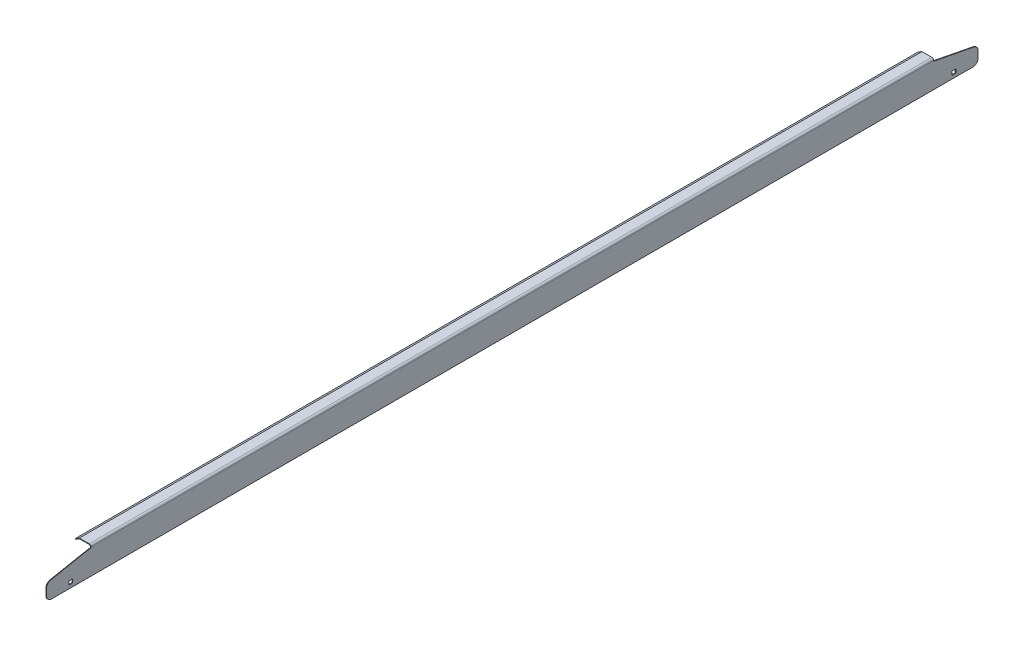
ISO-10303-21;
HEADER;
FILE_DESCRIPTION(('STEP AP214'),'2;1');
FILE_NAME('part.step','',(''),(''),'','','');
FILE_SCHEMA(('AUTOMOTIVE_DESIGN { 1 0 10303 214 1 1 1 1 }'));
ENDSEC;
DATA;
#1=APPLICATION_CONTEXT('core data for automotive mechanical design processes');
#2=APPLICATION_PROTOCOL_DEFINITION('international standard','automotive_design',2000,#1);
#3=PRODUCT_CONTEXT('',#1,'mechanical');
#4=PRODUCT('Part','Part','',(#3));
#5=PRODUCT_RELATED_PRODUCT_CATEGORY('part','',(#4));
#6=PRODUCT_DEFINITION_FORMATION('','',#4);
#7=PRODUCT_DEFINITION_CONTEXT('part definition',#1,'design');
#8=PRODUCT_DEFINITION('design','',#6,#7);
#9=PRODUCT_DEFINITION_SHAPE('','',#8);
#10=(LENGTH_UNIT() NAMED_UNIT(*) SI_UNIT(.MILLI.,.METRE.));
#11=(NAMED_UNIT(*) PLANE_ANGLE_UNIT() SI_UNIT($,.RADIAN.));
#12=(NAMED_UNIT(*) SI_UNIT($,.STERADIAN.) SOLID_ANGLE_UNIT());
#13=UNCERTAINTY_MEASURE_WITH_UNIT(LENGTH_MEASURE(1.E-05),#10,'distance_accuracy_value','');
#14=(GEOMETRIC_REPRESENTATION_CONTEXT(3) GLOBAL_UNCERTAINTY_ASSIGNED_CONTEXT((#13)) GLOBAL_UNIT_ASSIGNED_CONTEXT((#10,
#11,#12)) REPRESENTATION_CONTEXT('',''));
#15=CARTESIAN_POINT('',(0.,0.,0.));
#16=DIRECTION('',(0.,0.,1.));
#17=DIRECTION('',(1.,0.,0.));
#18=AXIS2_PLACEMENT_3D('',#15,#16,#17);
#19=CARTESIAN_POINT('',(1122.68,31.75,599.28125));
#20=DIRECTION('',(0.855197831640066,0.518301715951365,0.));
#21=DIRECTION('',(-0.518301715951365,0.855197831640066,0.));
#22=AXIS2_PLACEMENT_3D('',#19,#20,#21);
#23=PLANE('',#22);
#24=DIRECTION('',(0.518301716093364,-0.855197831554006,0.));
#25=VECTOR('',#24,1.);
#26=CARTESIAN_POINT('',(1122.68,31.75,542.13125));
#27=LINE('',#26,#25);
#28=CARTESIAN_POINT('',(1122.68,31.75,542.13125));
#29=VERTEX_POINT('',#28);
#30=CARTESIAN_POINT('',(1123.09140198655,31.0711867221883,542.13125));
#31=VERTEX_POINT('',#30);
#32=EDGE_CURVE('E273',#29,#31,#27,.T.);
#33=ORIENTED_EDGE('',*,*,#32,.F.);
#34=DIRECTION('',(0.,0.,-1.));
#35=VECTOR('',#34,1.);
#36=CARTESIAN_POINT('',(1122.68,31.75,599.28125));
#37=LINE('',#36,#35);
#38=CARTESIAN_POINT('',(1122.68,31.75,-542.13125));
#39=VERTEX_POINT('',#38);
#40=EDGE_CURVE('E357',#29,#39,#37,.T.);
#41=ORIENTED_EDGE('',*,*,#40,.T.);
#42=DIRECTION('',(-0.51830171609338,0.855197831553996,0.));
#43=VECTOR('',#42,1.);
#44=CARTESIAN_POINT('',(1122.68,31.75,-542.131249999999));
#45=LINE('',#44,#43);
#46=CARTESIAN_POINT('',(1123.09140198655,31.0711867221883,-542.131249999999));
#47=VERTEX_POINT('',#46);
#48=EDGE_CURVE('E276',#47,#39,#45,.T.);
#49=ORIENTED_EDGE('',*,*,#48,.F.);
#50=DIRECTION('',(0.,0.,-1.));
#51=VECTOR('',#50,1.);
#52=CARTESIAN_POINT('',(1123.09140198644,31.07118672212,599.28125));
#53=LINE('',#52,#51);
#54=EDGE_CURVE('E355',#31,#47,#53,.T.);
#55=ORIENTED_EDGE('',*,*,#54,.F.);
#56=EDGE_LOOP('',(#33,#41,#49,#55));
#57=FACE_BOUND('',#56,.T.);
#58=ADVANCED_FACE('F31',(#57),#23,.F.);
#59=CARTESIAN_POINT('',(1123.09140198644,31.07118672212,599.28125));
#60=DIRECTION('',(-0.518301715959872,0.85519783163491,0.));
#61=DIRECTION('',(-0.85519783163491,-0.518301715959872,0.));
#62=AXIS2_PLACEMENT_3D('',#59,#60,#61);
#63=PLANE('',#62);
#64=DIRECTION('',(-0.85519783163491,-0.518301715959872,0.));
#65=VECTOR('',#64,1.);
#66=CARTESIAN_POINT('',(1123.09140198644,31.07118672212,542.13125));
#67=LINE('',#66,#65);
#68=CARTESIAN_POINT('',(1128.14050639672,34.13125,542.13125));
#69=VERTEX_POINT('',#68);
#70=EDGE_CURVE('E296',#69,#31,#67,.T.);
#71=ORIENTED_EDGE('',*,*,#70,.T.);
#72=ORIENTED_EDGE('',*,*,#54,.T.);
#73=DIRECTION('',(0.85519783163491,0.518301715959872,0.));
#74=VECTOR('',#73,1.);
#75=CARTESIAN_POINT('',(1123.09140198642,31.0711867221093,-542.13125));
#76=LINE('',#75,#74);
#77=CARTESIAN_POINT('',(1128.14050639672,34.13125,-542.13125));
#78=VERTEX_POINT('',#77);
#79=EDGE_CURVE('E324',#47,#78,#76,.T.);
#80=ORIENTED_EDGE('',*,*,#79,.T.);
#81=DIRECTION('',(0.,0.,-1.));
#82=VECTOR('',#81,1.);
#83=CARTESIAN_POINT('',(1128.14050639672,34.13125,599.28125));
#84=LINE('',#83,#82);
#85=EDGE_CURVE('E353',#69,#78,#84,.T.);
#86=ORIENTED_EDGE('',*,*,#85,.F.);
#87=EDGE_LOOP('',(#71,#72,#80,#86));
#88=FACE_BOUND('',#87,.T.);
#89=ADVANCED_FACE('F435',(#88),#63,.F.);
#90=CARTESIAN_POINT('',(1143.,32.54375,599.28125));
#91=DIRECTION('',(-1.,0.,0.));
#92=DIRECTION('',(0.,0.,1.));
#93=AXIS2_PLACEMENT_3D('',#90,#91,#92);
#94=PLANE('',#93);
#95=DIRECTION('',(0.,0.,-1.));
#96=VECTOR('',#95,1.);
#97=CARTESIAN_POINT('',(1143.,4.2418,570.70625));
#98=LINE('',#97,#96);
#99=CARTESIAN_POINT('',(1143.,4.2418,570.70625));
#100=VERTEX_POINT('',#99);
#101=CARTESIAN_POINT('',(1143.,4.2418,565.94375));
#102=VERTEX_POINT('',#101);
#103=EDGE_CURVE('E222',#100,#102,#98,.T.);
#104=ORIENTED_EDGE('',*,*,#103,.F.);
#105=DIRECTION('',(0.,-1.,0.));
#106=VECTOR('',#105,1.);
#107=CARTESIAN_POINT('',(1143.,4.2418,570.70625));
#108=LINE('',#107,#106);
#109=CARTESIAN_POINT('',(1143.,9.0043,570.70625));
#110=VERTEX_POINT('',#109);
#111=EDGE_CURVE('E227',#110,#100,#108,.T.);
#112=ORIENTED_EDGE('',*,*,#111,.F.);
#113=DIRECTION('',(0.,0.,1.));
#114=VECTOR('',#113,1.);
#115=CARTESIAN_POINT('',(1143.,9.0043,570.70625));
#116=LINE('',#115,#114);
#117=CARTESIAN_POINT('',(1143.,9.0043,565.94375));
#118=VERTEX_POINT('',#117);
#119=EDGE_CURVE('E232',#118,#110,#116,.T.);
#120=ORIENTED_EDGE('',*,*,#119,.F.);
#121=DIRECTION('',(0.,1.,0.));
#122=VECTOR('',#121,1.);
#123=CARTESIAN_POINT('',(1143.,4.2418,565.94375));
#124=LINE('',#123,#122);
#125=EDGE_CURVE('E211',#102,#118,#124,.T.);
#126=ORIENTED_EDGE('',*,*,#125,.F.);
#127=EDGE_LOOP('',(#104,#112,#120,#126));
#128=FACE_BOUND('',#127,.T.);
#129=DIRECTION('',(0.,0.,1.));
#130=VECTOR('',#129,1.);
#131=CARTESIAN_POINT('',(1143.,9.0043,-570.70625));
#132=LINE('',#131,#130);
#133=CARTESIAN_POINT('',(1143.,9.0043,-570.70625));
#134=VERTEX_POINT('',#133);
#135=CARTESIAN_POINT('',(1143.,9.0043,-565.94375));
#136=VERTEX_POINT('',#135);
#137=EDGE_CURVE('E255',#134,#136,#132,.T.);
#138=ORIENTED_EDGE('',*,*,#137,.F.);
#139=DIRECTION('',(0.,1.,0.));
#140=VECTOR('',#139,1.);
#141=CARTESIAN_POINT('',(1143.,4.2418,-570.70625));
#142=LINE('',#141,#140);
#143=CARTESIAN_POINT('',(1143.,4.2418,-570.70625));
#144=VERTEX_POINT('',#143);
#145=EDGE_CURVE('E243',#144,#134,#142,.T.);
#146=ORIENTED_EDGE('',*,*,#145,.F.);
#147=DIRECTION('',(0.,0.,-1.));
#148=VECTOR('',#147,1.);
#149=CARTESIAN_POINT('',(1143.,4.2418,-570.70625));
#150=LINE('',#149,#148);
#151=CARTESIAN_POINT('',(1143.,4.2418,-565.94375));
#152=VERTEX_POINT('',#151);
#153=EDGE_CURVE('E261',#152,#144,#150,.T.);
#154=ORIENTED_EDGE('',*,*,#153,.F.);
#155=DIRECTION('',(0.,-1.,0.));
#156=VECTOR('',#155,1.);
#157=CARTESIAN_POINT('',(1143.,4.2418,-565.94375));
#158=LINE('',#157,#156);
#159=EDGE_CURVE('E258',#136,#152,#158,.T.);
#160=ORIENTED_EDGE('',*,*,#159,.F.);
#161=EDGE_LOOP('',(#138,#146,#154,#160));
#162=FACE_BOUND('',#161,.T.);
#163=DIRECTION('',(0.,0.,-1.));
#164=VECTOR('',#163,1.);
#165=CARTESIAN_POINT('',(1143.,0.,599.28125));
#166=LINE('',#165,#164);
#167=CARTESIAN_POINT('',(1143.,0.,592.93125));
#168=VERTEX_POINT('',#167);
#169=CARTESIAN_POINT('',(1143.,0.,-592.93125));
#170=VERTEX_POINT('',#169);
#171=EDGE_CURVE('E339',#168,#170,#166,.T.);
#172=ORIENTED_EDGE('',*,*,#171,.T.);
#173=CARTESIAN_POINT('',(1143.,6.35,-592.93125));
#174=DIRECTION('',(-1.,0.,0.));
#175=DIRECTION('',(0.,0.,1.));
#176=AXIS2_PLACEMENT_3D('',#173,#174,#175);
#177=CIRCLE('',#176,6.35);
#178=CARTESIAN_POINT('',(1143.,6.35,-599.28125));
#179=VERTEX_POINT('',#178);
#180=EDGE_CURVE('E383',#170,#179,#177,.F.);
#181=ORIENTED_EDGE('',*,*,#180,.T.);
#182=DIRECTION('',(0.,1.,0.));
#183=VECTOR('',#182,1.);
#184=CARTESIAN_POINT('',(1143.,32.54375,-599.28125));
#185=LINE('',#184,#183);
#186=CARTESIAN_POINT('',(1143.,15.4148515670641,-599.28125));
#187=VERTEX_POINT('',#186);
#188=EDGE_CURVE('E333',#179,#187,#185,.T.);
#189=ORIENTED_EDGE('',*,*,#188,.T.);
#190=CARTESIAN_POINT('',(1143.,15.4148515670641,-592.93125));
#191=DIRECTION('',(-1.,0.,0.));
#192=DIRECTION('',(0.,0.,1.));
#193=AXIS2_PLACEMENT_3D('',#190,#191,#192);
#194=CIRCLE('',#193,6.35);
#195=CARTESIAN_POINT('',(1143.,21.6483686853221,-594.141937546968));
#196=VERTEX_POINT('',#195);
#197=EDGE_CURVE('E381',#187,#196,#194,.F.);
#198=ORIENTED_EDGE('',*,*,#197,.T.);
#199=DIRECTION('',(0.,-0.190659456215486,-0.981656239095752));
#200=VECTOR('',#199,1.);
#201=CARTESIAN_POINT('',(1143.,31.75,-542.13125));
#202=LINE('',#201,#200);
#203=CARTESIAN_POINT('',(1143.,31.75,-542.13125));
#204=VERTEX_POINT('',#203);
#205=EDGE_CURVE('E307',#204,#196,#202,.T.);
#206=ORIENTED_EDGE('',*,*,#205,.F.);
#207=DIRECTION('',(0.,-1.,0.));
#208=VECTOR('',#207,1.);
#209=CARTESIAN_POINT('',(1143.,34.925,-542.13125));
#210=LINE('',#209,#208);
#211=CARTESIAN_POINT('',(1143.,32.54375,-542.13125));
#212=VERTEX_POINT('',#211);
#213=EDGE_CURVE('E304',#212,#204,#210,.T.);
#214=ORIENTED_EDGE('',*,*,#213,.F.);
#215=DIRECTION('',(0.,0.,-1.));
#216=VECTOR('',#215,1.);
#217=CARTESIAN_POINT('',(1143.,32.54375,599.28125));
#218=LINE('',#217,#216);
#219=CARTESIAN_POINT('',(1143.,32.54375,542.13125));
#220=VERTEX_POINT('',#219);
#221=EDGE_CURVE('E364',#220,#212,#218,.T.);
#222=ORIENTED_EDGE('',*,*,#221,.F.);
#223=DIRECTION('',(0.,1.,0.));
#224=VECTOR('',#223,1.);
#225=CARTESIAN_POINT('',(1143.,34.925,542.13125));
#226=LINE('',#225,#224);
#227=CARTESIAN_POINT('',(1143.,31.75,542.13125));
#228=VERTEX_POINT('',#227);
#229=EDGE_CURVE('E280',#228,#220,#226,.T.);
#230=ORIENTED_EDGE('',*,*,#229,.F.);
#231=DIRECTION('',(0.,0.190659456215486,-0.981656239095751));
#232=VECTOR('',#231,1.);
#233=CARTESIAN_POINT('',(1143.,31.75,542.13125));
#234=LINE('',#233,#232);
#235=CARTESIAN_POINT('',(1143.,21.6483686853221,594.141937546968));
#236=VERTEX_POINT('',#235);
#237=EDGE_CURVE('E278',#236,#228,#234,.T.);
#238=ORIENTED_EDGE('',*,*,#237,.F.);
#239=CARTESIAN_POINT('',(1143.,15.4148515670641,592.93125));
#240=DIRECTION('',(-1.,0.,0.));
#241=DIRECTION('',(0.,0.,1.));
#242=AXIS2_PLACEMENT_3D('',#239,#240,#241);
#243=CIRCLE('',#242,6.35);
#244=CARTESIAN_POINT('',(1143.,15.4148515670641,599.28125));
#245=VERTEX_POINT('',#244);
#246=EDGE_CURVE('E377',#236,#245,#243,.F.);
#247=ORIENTED_EDGE('',*,*,#246,.T.);
#248=DIRECTION('',(0.,1.,0.));
#249=VECTOR('',#248,1.);
#250=CARTESIAN_POINT('',(1143.,32.54375,599.28125));
#251=LINE('',#250,#249);
#252=CARTESIAN_POINT('',(1143.,6.35,599.28125));
#253=VERTEX_POINT('',#252);
#254=EDGE_CURVE('E334',#253,#245,#251,.T.);
#255=ORIENTED_EDGE('',*,*,#254,.F.);
#256=CARTESIAN_POINT('',(1143.,6.35,592.93125));
#257=DIRECTION('',(-1.,0.,0.));
#258=DIRECTION('',(0.,0.,1.));
#259=AXIS2_PLACEMENT_3D('',#256,#257,#258);
#260=CIRCLE('',#259,6.35);
#261=EDGE_CURVE('E379',#253,#168,#260,.F.);
#262=ORIENTED_EDGE('',*,*,#261,.T.);
#263=EDGE_LOOP('',(#172,#181,#189,#198,#206,#214,#222,#230,#238,#247,#255,#262));
#264=FACE_BOUND('',#263,.T.);
#265=ADVANCED_FACE('F229',(#128,#162,#264),#94,.F.);
#266=CARTESIAN_POINT('',(1140.61875,32.54375,599.28125));
#267=DIRECTION('',(0.,0.,-1.));
#268=DIRECTION('',(-1.,0.,0.));
#269=AXIS2_PLACEMENT_3D('',#266,#267,#268);
#270=CYLINDRICAL_SURFACE('',#269,2.38125);
#271=DIRECTION('',(0.,0.,-1.));
#272=VECTOR('',#271,1.);
#273=CARTESIAN_POINT('',(1140.61875,34.925,599.28125));
#274=LINE('',#273,#272);
#275=CARTESIAN_POINT('',(1140.61875,34.925,542.13125));
#276=VERTEX_POINT('',#275);
#277=CARTESIAN_POINT('',(1140.61875,34.925,-542.13125));
#278=VERTEX_POINT('',#277);
#279=EDGE_CURVE('E362',#276,#278,#274,.T.);
#280=ORIENTED_EDGE('',*,*,#279,.F.);
#281=CARTESIAN_POINT('',(1140.61875,32.54375,542.13125));
#282=DIRECTION('',(0.,0.,-1.));
#283=DIRECTION('',(-1.,0.,0.));
#284=AXIS2_PLACEMENT_3D('',#281,#282,#283);
#285=CIRCLE('',#284,2.38125);
#286=EDGE_CURVE('E301',#276,#220,#285,.T.);
#287=ORIENTED_EDGE('',*,*,#286,.T.);
#288=ORIENTED_EDGE('',*,*,#221,.T.);
#289=CARTESIAN_POINT('',(1140.61875,32.54375,-542.13125));
#290=DIRECTION('',(0.,0.,1.));
#291=DIRECTION('',(0.,-1.,0.));
#292=AXIS2_PLACEMENT_3D('',#289,#290,#291);
#293=CIRCLE('',#292,2.38125);
#294=EDGE_CURVE('E330',#212,#278,#293,.T.);
#295=ORIENTED_EDGE('',*,*,#294,.T.);
#296=EDGE_LOOP('',(#280,#287,#288,#295));
#297=FACE_BOUND('',#296,.T.);
#298=ADVANCED_FACE('F448',(#297),#270,.T.);
#299=CARTESIAN_POINT('',(1127.91875,34.925,599.28125));
#300=DIRECTION('',(0.,-1.,0.));
#301=DIRECTION('',(0.,0.,-1.));
#302=AXIS2_PLACEMENT_3D('',#299,#300,#301);
#303=PLANE('',#302);
#304=DIRECTION('',(0.,0.,-1.));
#305=VECTOR('',#304,1.);
#306=CARTESIAN_POINT('',(1127.91875,34.925,599.28125));
#307=LINE('',#306,#305);
#308=CARTESIAN_POINT('',(1127.91875,34.925,542.13125));
#309=VERTEX_POINT('',#308);
#310=CARTESIAN_POINT('',(1127.91875,34.925,-542.13125));
#311=VERTEX_POINT('',#310);
#312=EDGE_CURVE('E360',#309,#311,#307,.T.);
#313=ORIENTED_EDGE('',*,*,#312,.F.);
#314=DIRECTION('',(1.,0.,0.));
#315=VECTOR('',#314,1.);
#316=CARTESIAN_POINT('',(1117.6,34.925,542.13125));
#317=LINE('',#316,#315);
#318=EDGE_CURVE('E283',#309,#276,#317,.T.);
#319=ORIENTED_EDGE('',*,*,#318,.T.);
#320=ORIENTED_EDGE('',*,*,#279,.T.);
#321=DIRECTION('',(1.,0.,0.));
#322=VECTOR('',#321,1.);
#323=CARTESIAN_POINT('',(1117.6,34.925,-542.13125));
#324=LINE('',#323,#322);
#325=EDGE_CURVE('E310',#311,#278,#324,.T.);
#326=ORIENTED_EDGE('',*,*,#325,.F.);
#327=EDGE_LOOP('',(#313,#319,#320,#326));
#328=FACE_BOUND('',#327,.T.);
#329=ADVANCED_FACE('F445',(#328),#303,.F.);
#330=CARTESIAN_POINT('',(1127.91875,34.925,599.28125));
#331=DIRECTION('',(0.518301716093363,-0.855197831554006,0.));
#332=DIRECTION('',(0.855197831554007,0.518301716093363,0.));
#333=AXIS2_PLACEMENT_3D('',#330,#331,#332);
#334=PLANE('',#333);
#335=ORIENTED_EDGE('',*,*,#40,.F.);
#336=DIRECTION('',(0.855197831554007,0.518301716093363,0.));
#337=VECTOR('',#336,1.);
#338=CARTESIAN_POINT('',(1127.91875,34.925,542.13125));
#339=LINE('',#338,#337);
#340=EDGE_CURVE('E298',#29,#309,#339,.T.);
#341=ORIENTED_EDGE('',*,*,#340,.T.);
#342=ORIENTED_EDGE('',*,*,#312,.T.);
#343=DIRECTION('',(-0.855197831554007,-0.518301716093363,0.));
#344=VECTOR('',#343,1.);
#345=CARTESIAN_POINT('',(1127.91874999998,34.9249999999893,-542.13125));
#346=LINE('',#345,#344);
#347=EDGE_CURVE('E327',#311,#39,#346,.T.);
#348=ORIENTED_EDGE('',*,*,#347,.T.);
#349=EDGE_LOOP('',(#335,#341,#342,#348));
#350=FACE_BOUND('',#349,.T.);
#351=ADVANCED_FACE('F487',(#350),#334,.F.);
#352=CARTESIAN_POINT('',(1140.61875,34.13125,599.28125));
#353=DIRECTION('',(0.,1.,0.));
#354=DIRECTION('',(0.,0.,1.));
#355=AXIS2_PLACEMENT_3D('',#352,#353,#354);
#356=PLANE('',#355);
#357=DIRECTION('',(0.,0.,-1.));
#358=VECTOR('',#357,1.);
#359=CARTESIAN_POINT('',(1140.61875,34.1312499999999,599.28125));
#360=LINE('',#359,#358);
#361=CARTESIAN_POINT('',(1140.61875,34.1312499999999,542.13125));
#362=VERTEX_POINT('',#361);
#363=CARTESIAN_POINT('',(1140.61875,34.1312499999999,-542.13125));
#364=VERTEX_POINT('',#363);
#365=EDGE_CURVE('E351',#362,#364,#360,.T.);
#366=ORIENTED_EDGE('',*,*,#365,.F.);
#367=DIRECTION('',(-1.,0.,0.));
#368=VECTOR('',#367,1.);
#369=CARTESIAN_POINT('',(1140.61875,34.13125,542.13125));
#370=LINE('',#369,#368);
#371=EDGE_CURVE('E293',#362,#69,#370,.T.);
#372=ORIENTED_EDGE('',*,*,#371,.T.);
#373=ORIENTED_EDGE('',*,*,#85,.T.);
#374=DIRECTION('',(1.,0.,0.));
#375=VECTOR('',#374,1.);
#376=CARTESIAN_POINT('',(1140.61875,34.13125,-542.13125));
#377=LINE('',#376,#375);
#378=EDGE_CURVE('E321',#78,#364,#377,.T.);
#379=ORIENTED_EDGE('',*,*,#378,.T.);
#380=EDGE_LOOP('',(#366,#372,#373,#379));
#381=FACE_BOUND('',#380,.T.);
#382=ADVANCED_FACE('F425',(#381),#356,.F.);
#383=CARTESIAN_POINT('',(1140.61875,32.54375,599.28125));
#384=DIRECTION('',(0.,0.,-1.));
#385=DIRECTION('',(-1.,0.,0.));
#386=AXIS2_PLACEMENT_3D('',#383,#384,#385);
#387=CYLINDRICAL_SURFACE('',#386,1.58749999999993);
#388=DIRECTION('',(0.,0.,-1.));
#389=VECTOR('',#388,1.);
#390=CARTESIAN_POINT('',(1142.20625,32.54375,599.28125));
#391=LINE('',#390,#389);
#392=CARTESIAN_POINT('',(1142.20625,32.54375,542.13125));
#393=VERTEX_POINT('',#392);
#394=CARTESIAN_POINT('',(1142.20625,32.54375,-542.13125));
#395=VERTEX_POINT('',#394);
#396=EDGE_CURVE('E349',#393,#395,#391,.T.);
#397=ORIENTED_EDGE('',*,*,#396,.F.);
#398=CARTESIAN_POINT('',(1140.61875,32.54375,542.13125));
#399=DIRECTION('',(0.,0.,-1.));
#400=DIRECTION('',(-1.,0.,0.));
#401=AXIS2_PLACEMENT_3D('',#398,#399,#400);
#402=CIRCLE('',#401,1.58749999999993);
#403=EDGE_CURVE('E290',#393,#362,#402,.F.);
#404=ORIENTED_EDGE('',*,*,#403,.T.);
#405=ORIENTED_EDGE('',*,*,#365,.T.);
#406=CARTESIAN_POINT('',(1140.61875,32.54375,-542.13125));
#407=DIRECTION('',(0.,0.,1.));
#408=DIRECTION('',(0.,-1.,0.));
#409=AXIS2_PLACEMENT_3D('',#406,#407,#408);
#410=CIRCLE('',#409,1.58749999999993);
#411=EDGE_CURVE('E318',#364,#395,#410,.F.);
#412=ORIENTED_EDGE('',*,*,#411,.T.);
#413=EDGE_LOOP('',(#397,#404,#405,#412));
#414=FACE_BOUND('',#413,.T.);
#415=ADVANCED_FACE('F422',(#414),#387,.F.);
#416=CARTESIAN_POINT('',(1142.20625,0.,599.28125));
#417=DIRECTION('',(1.,0.,0.));
#418=DIRECTION('',(0.,0.,-1.));
#419=AXIS2_PLACEMENT_3D('',#416,#417,#418);
#420=PLANE('',#419);
#421=DIRECTION('',(0.,0.,-1.));
#422=VECTOR('',#421,1.);
#423=CARTESIAN_POINT('',(1142.20625,9.0043,570.70625));
#424=LINE('',#423,#422);
#425=CARTESIAN_POINT('',(1142.20625,9.0043,570.70625));
#426=VERTEX_POINT('',#425);
#427=CARTESIAN_POINT('',(1142.20625,9.0043,565.94375));
#428=VERTEX_POINT('',#427);
#429=EDGE_CURVE('E717',#426,#428,#424,.T.);
#430=ORIENTED_EDGE('',*,*,#429,.F.);
#431=DIRECTION('',(0.,1.,0.));
#432=VECTOR('',#431,1.);
#433=CARTESIAN_POINT('',(1142.20625,4.2418,570.70625));
#434=LINE('',#433,#432);
#435=CARTESIAN_POINT('',(1142.20625,4.2418,570.70625));
#436=VERTEX_POINT('',#435);
#437=EDGE_CURVE('E244',#436,#426,#434,.T.);
#438=ORIENTED_EDGE('',*,*,#437,.F.);
#439=DIRECTION('',(0.,0.,1.));
#440=VECTOR('',#439,1.);
#441=CARTESIAN_POINT('',(1142.20625,4.2418,570.70625));
#442=LINE('',#441,#440);
#443=CARTESIAN_POINT('',(1142.20625,4.2418,565.94375));
#444=VERTEX_POINT('',#443);
#445=EDGE_CURVE('E241',#444,#436,#442,.T.);
#446=ORIENTED_EDGE('',*,*,#445,.F.);
#447=DIRECTION('',(0.,-1.,0.));
#448=VECTOR('',#447,1.);
#449=CARTESIAN_POINT('',(1142.20625,4.2418,565.94375));
#450=LINE('',#449,#448);
#451=EDGE_CURVE('E214',#428,#444,#450,.T.);
#452=ORIENTED_EDGE('',*,*,#451,.F.);
#453=EDGE_LOOP('',(#430,#438,#446,#452));
#454=FACE_BOUND('',#453,.T.);
#455=DIRECTION('',(0.,0.,1.));
#456=VECTOR('',#455,1.);
#457=CARTESIAN_POINT('',(1142.20625,4.2418,-570.70625));
#458=LINE('',#457,#456);
#459=CARTESIAN_POINT('',(1142.20625,4.2418,-570.70625));
#460=VERTEX_POINT('',#459);
#461=CARTESIAN_POINT('',(1142.20625,4.2418,-565.94375));
#462=VERTEX_POINT('',#461);
#463=EDGE_CURVE('E248',#460,#462,#458,.T.);
#464=ORIENTED_EDGE('',*,*,#463,.F.);
#465=DIRECTION('',(0.,-1.,0.));
#466=VECTOR('',#465,1.);
#467=CARTESIAN_POINT('',(1142.20625,4.2418,-570.70625));
#468=LINE('',#467,#466);
#469=CARTESIAN_POINT('',(1142.20625,9.0043,-570.70625));
#470=VERTEX_POINT('',#469);
#471=EDGE_CURVE('E251',#470,#460,#468,.T.);
#472=ORIENTED_EDGE('',*,*,#471,.F.);
#473=DIRECTION('',(0.,0.,-1.));
#474=VECTOR('',#473,1.);
#475=CARTESIAN_POINT('',(1142.20625,9.0043,-570.70625));
#476=LINE('',#475,#474);
#477=CARTESIAN_POINT('',(1142.20625,9.0043,-565.94375));
#478=VERTEX_POINT('',#477);
#479=EDGE_CURVE('E253',#478,#470,#476,.T.);
#480=ORIENTED_EDGE('',*,*,#479,.F.);
#481=DIRECTION('',(0.,1.,0.));
#482=VECTOR('',#481,1.);
#483=CARTESIAN_POINT('',(1142.20625,4.2418,-565.94375));
#484=LINE('',#483,#482);
#485=EDGE_CURVE('E245',#462,#478,#484,.T.);
#486=ORIENTED_EDGE('',*,*,#485,.F.);
#487=EDGE_LOOP('',(#464,#472,#480,#486));
#488=FACE_BOUND('',#487,.T.);
#489=DIRECTION('',(0.,-1.,0.));
#490=VECTOR('',#489,1.);
#491=CARTESIAN_POINT('',(1142.20625,0.,-599.28125));
#492=LINE('',#491,#490);
#493=CARTESIAN_POINT('',(1142.20625,15.4148515670641,-599.28125));
#494=VERTEX_POINT('',#493);
#495=CARTESIAN_POINT('',(1142.20625,6.35,-599.28125));
#496=VERTEX_POINT('',#495);
#497=EDGE_CURVE('E337',#494,#496,#492,.T.);
#498=ORIENTED_EDGE('',*,*,#497,.T.);
#499=CARTESIAN_POINT('',(1142.20625,6.35,-592.93125));
#500=DIRECTION('',(1.,0.,0.));
#501=DIRECTION('',(0.,0.,-1.));
#502=AXIS2_PLACEMENT_3D('',#499,#500,#501);
#503=CIRCLE('',#502,6.35);
#504=CARTESIAN_POINT('',(1142.20625,0.,-592.93125));
#505=VERTEX_POINT('',#504);
#506=EDGE_CURVE('E395',#496,#505,#503,.F.);
#507=ORIENTED_EDGE('',*,*,#506,.T.);
#508=DIRECTION('',(0.,0.,-1.));
#509=VECTOR('',#508,1.);
#510=CARTESIAN_POINT('',(1142.20625,0.,599.28125));
#511=LINE('',#510,#509);
#512=CARTESIAN_POINT('',(1142.20625,0.,592.93125));
#513=VERTEX_POINT('',#512);
#514=EDGE_CURVE('E346',#513,#505,#511,.T.);
#515=ORIENTED_EDGE('',*,*,#514,.F.);
#516=CARTESIAN_POINT('',(1142.20625,6.35,592.93125));
#517=DIRECTION('',(1.,0.,0.));
#518=DIRECTION('',(0.,0.,-1.));
#519=AXIS2_PLACEMENT_3D('',#516,#517,#518);
#520=CIRCLE('',#519,6.35);
#521=CARTESIAN_POINT('',(1142.20625,6.35,599.28125));
#522=VERTEX_POINT('',#521);
#523=EDGE_CURVE('E46',#513,#522,#520,.F.);
#524=ORIENTED_EDGE('',*,*,#523,.T.);
#525=DIRECTION('',(0.,-1.,0.));
#526=VECTOR('',#525,1.);
#527=CARTESIAN_POINT('',(1142.20625,0.,599.28125));
#528=LINE('',#527,#526);
#529=CARTESIAN_POINT('',(1142.20625,15.4148515670641,599.28125));
#530=VERTEX_POINT('',#529);
#531=EDGE_CURVE('E336',#530,#522,#528,.T.);
#532=ORIENTED_EDGE('',*,*,#531,.F.);
#533=CARTESIAN_POINT('',(1142.20625,15.4148515670641,592.93125));
#534=DIRECTION('',(1.,0.,0.));
#535=DIRECTION('',(0.,0.,-1.));
#536=AXIS2_PLACEMENT_3D('',#533,#534,#535);
#537=CIRCLE('',#536,6.35);
#538=CARTESIAN_POINT('',(1142.20625,21.6483686853222,594.141937546968));
#539=VERTEX_POINT('',#538);
#540=EDGE_CURVE('E390',#530,#539,#537,.F.);
#541=ORIENTED_EDGE('',*,*,#540,.T.);
#542=DIRECTION('',(0.,0.190659456215486,-0.981656239095752));
#543=VECTOR('',#542,1.);
#544=CARTESIAN_POINT('',(1142.20625,19.8995439965478,603.146183656218));
#545=LINE('',#544,#543);
#546=CARTESIAN_POINT('',(1142.20625,31.75,542.13125));
#547=VERTEX_POINT('',#546);
#548=EDGE_CURVE('E286',#539,#547,#545,.T.);
#549=ORIENTED_EDGE('',*,*,#548,.T.);
#550=DIRECTION('',(0.,1.,0.));
#551=VECTOR('',#550,1.);
#552=CARTESIAN_POINT('',(1142.20625,0.,542.13125));
#553=LINE('',#552,#551);
#554=EDGE_CURVE('E369',#547,#393,#553,.T.);
#555=ORIENTED_EDGE('',*,*,#554,.T.);
#556=ORIENTED_EDGE('',*,*,#396,.T.);
#557=DIRECTION('',(0.,-1.,0.));
#558=VECTOR('',#557,1.);
#559=CARTESIAN_POINT('',(1142.20625,-3.99125177352744E-11,-542.131249999999));
#560=LINE('',#559,#558);
#561=CARTESIAN_POINT('',(1142.20625,31.75,-542.13125));
#562=VERTEX_POINT('',#561);
#563=EDGE_CURVE('E366',#395,#562,#560,.T.);
#564=ORIENTED_EDGE('',*,*,#563,.T.);
#565=DIRECTION('',(0.,-0.190659456215486,-0.981656239095752));
#566=VECTOR('',#565,1.);
#567=CARTESIAN_POINT('',(1142.20625,244.224952241081,551.847337053621));
#568=LINE('',#567,#566);
#569=CARTESIAN_POINT('',(1142.20625,21.6483686853221,-594.141937546969));
#570=VERTEX_POINT('',#569);
#571=EDGE_CURVE('E313',#562,#570,#568,.T.);
#572=ORIENTED_EDGE('',*,*,#571,.T.);
#573=CARTESIAN_POINT('',(1142.20625,15.4148515670641,-592.93125));
#574=DIRECTION('',(1.,0.,0.));
#575=DIRECTION('',(0.,0.,-1.));
#576=AXIS2_PLACEMENT_3D('',#573,#574,#575);
#577=CIRCLE('',#576,6.35);
#578=EDGE_CURVE('E393',#570,#494,#577,.F.);
#579=ORIENTED_EDGE('',*,*,#578,.T.);
#580=EDGE_LOOP('',(#498,#507,#515,#524,#532,#541,#549,#555,#556,#564,#572,#579));
#581=FACE_BOUND('',#580,.T.);
#582=ADVANCED_FACE('F416',(#454,#488,#581),#420,.F.);
#583=CARTESIAN_POINT('',(1143.,0.,599.28125));
#584=DIRECTION('',(0.,1.,0.));
#585=DIRECTION('',(0.,0.,1.));
#586=AXIS2_PLACEMENT_3D('',#583,#584,#585);
#587=PLANE('',#586);
#588=ORIENTED_EDGE('',*,*,#514,.T.);
#589=DIRECTION('',(1.,0.,0.));
#590=VECTOR('',#589,1.);
#591=CARTESIAN_POINT('',(1143.,0.,-592.93125));
#592=LINE('',#591,#590);
#593=EDGE_CURVE('E374',#505,#170,#592,.T.);
#594=ORIENTED_EDGE('',*,*,#593,.T.);
#595=ORIENTED_EDGE('',*,*,#171,.F.);
#596=DIRECTION('',(1.,0.,0.));
#597=VECTOR('',#596,1.);
#598=CARTESIAN_POINT('',(1142.20625,0.,592.93125));
#599=LINE('',#598,#597);
#600=EDGE_CURVE('E372',#168,#513,#599,.F.);
#601=ORIENTED_EDGE('',*,*,#600,.T.);
#602=EDGE_LOOP('',(#588,#594,#595,#601));
#603=FACE_BOUND('',#602,.T.);
#604=ADVANCED_FACE('F470',(#603),#587,.F.);
#605=CARTESIAN_POINT('',(1140.61875,32.54375,599.28125));
#606=DIRECTION('',(0.,0.,1.));
#607=DIRECTION('',(1.,0.,0.));
#608=AXIS2_PLACEMENT_3D('',#605,#606,#607);
#609=PLANE('',#608);
#610=ORIENTED_EDGE('',*,*,#531,.T.);
#611=DIRECTION('',(1.,0.,0.));
#612=VECTOR('',#611,1.);
#613=CARTESIAN_POINT('',(1143.,6.35,599.28125));
#614=LINE('',#613,#612);
#615=EDGE_CURVE('E39',#522,#253,#614,.T.);
#616=ORIENTED_EDGE('',*,*,#615,.T.);
#617=ORIENTED_EDGE('',*,*,#254,.T.);
#618=DIRECTION('',(1.,0.,0.));
#619=VECTOR('',#618,1.);
#620=CARTESIAN_POINT('',(1142.20625,15.4148515670641,599.28125));
#621=LINE('',#620,#619);
#622=EDGE_CURVE('E53',#245,#530,#621,.F.);
#623=ORIENTED_EDGE('',*,*,#622,.T.);
#624=EDGE_LOOP('',(#610,#616,#617,#623));
#625=FACE_BOUND('',#624,.T.);
#626=ADVANCED_FACE('F402',(#625),#609,.T.);
#627=CARTESIAN_POINT('',(1140.61875,32.54375,-599.28125));
#628=DIRECTION('',(0.,0.,1.));
#629=DIRECTION('',(1.,0.,0.));
#630=AXIS2_PLACEMENT_3D('',#627,#628,#629);
#631=PLANE('',#630);
#632=ORIENTED_EDGE('',*,*,#188,.F.);
#633=DIRECTION('',(1.,0.,0.));
#634=VECTOR('',#633,1.);
#635=CARTESIAN_POINT('',(1140.61875,6.35,-599.28125));
#636=LINE('',#635,#634);
#637=EDGE_CURVE('E388',#179,#496,#636,.F.);
#638=ORIENTED_EDGE('',*,*,#637,.T.);
#639=ORIENTED_EDGE('',*,*,#497,.F.);
#640=DIRECTION('',(1.,0.,0.));
#641=VECTOR('',#640,1.);
#642=CARTESIAN_POINT('',(1140.61875,15.4148515670641,-599.28125));
#643=LINE('',#642,#641);
#644=EDGE_CURVE('E385',#494,#187,#643,.T.);
#645=ORIENTED_EDGE('',*,*,#644,.T.);
#646=EDGE_LOOP('',(#632,#638,#639,#645));
#647=FACE_BOUND('',#646,.T.);
#648=ADVANCED_FACE('F464',(#647),#631,.F.);
#649=CARTESIAN_POINT('',(1117.6,34.925,-542.13125));
#650=DIRECTION('',(0.,0.,1.));
#651=DIRECTION('',(0.,-1.,0.));
#652=AXIS2_PLACEMENT_3D('',#649,#650,#651);
#653=PLANE('',#652);
#654=ORIENTED_EDGE('',*,*,#347,.F.);
#655=ORIENTED_EDGE('',*,*,#325,.T.);
#656=ORIENTED_EDGE('',*,*,#294,.F.);
#657=ORIENTED_EDGE('',*,*,#213,.T.);
#658=DIRECTION('',(1.,0.,0.));
#659=VECTOR('',#658,1.);
#660=CARTESIAN_POINT('',(1117.6,31.75,-542.13125));
#661=LINE('',#660,#659);
#662=EDGE_CURVE('E311',#562,#204,#661,.T.);
#663=ORIENTED_EDGE('',*,*,#662,.F.);
#664=ORIENTED_EDGE('',*,*,#563,.F.);
#665=ORIENTED_EDGE('',*,*,#411,.F.);
#666=ORIENTED_EDGE('',*,*,#378,.F.);
#667=ORIENTED_EDGE('',*,*,#79,.F.);
#668=ORIENTED_EDGE('',*,*,#48,.T.);
#669=EDGE_LOOP('',(#654,#655,#656,#657,#663,#664,#665,#666,#667,#668));
#670=FACE_BOUND('',#669,.T.);
#671=ADVANCED_FACE('F431',(#670),#653,.F.);
#672=CARTESIAN_POINT('',(1117.6,31.75,-542.13125));
#673=DIRECTION('',(0.,-0.981656239095751,0.190659456215486));
#674=DIRECTION('',(0.,-0.190659456215486,-0.981656239095752));
#675=AXIS2_PLACEMENT_3D('',#672,#673,#674);
#676=PLANE('',#675);
#677=ORIENTED_EDGE('',*,*,#205,.T.);
#678=DIRECTION('',(1.,0.,0.));
#679=VECTOR('',#678,1.);
#680=CARTESIAN_POINT('',(1117.6,21.6483686853221,-594.141937546968));
#681=LINE('',#680,#679);
#682=EDGE_CURVE('E397',#196,#570,#681,.F.);
#683=ORIENTED_EDGE('',*,*,#682,.T.);
#684=ORIENTED_EDGE('',*,*,#571,.F.);
#685=ORIENTED_EDGE('',*,*,#662,.T.);
#686=EDGE_LOOP('',(#677,#683,#684,#685));
#687=FACE_BOUND('',#686,.T.);
#688=ADVANCED_FACE('F455',(#687),#676,.F.);
#689=CARTESIAN_POINT('',(1117.6,34.925,542.13125));
#690=DIRECTION('',(0.,0.,-1.));
#691=DIRECTION('',(-1.,0.,0.));
#692=AXIS2_PLACEMENT_3D('',#689,#690,#691);
#693=PLANE('',#692);
#694=ORIENTED_EDGE('',*,*,#70,.F.);
#695=ORIENTED_EDGE('',*,*,#371,.F.);
#696=ORIENTED_EDGE('',*,*,#403,.F.);
#697=ORIENTED_EDGE('',*,*,#554,.F.);
#698=DIRECTION('',(1.,0.,0.));
#699=VECTOR('',#698,1.);
#700=CARTESIAN_POINT('',(1117.6,31.75,542.13125));
#701=LINE('',#700,#699);
#702=EDGE_CURVE('E282',#547,#228,#701,.T.);
#703=ORIENTED_EDGE('',*,*,#702,.T.);
#704=ORIENTED_EDGE('',*,*,#229,.T.);
#705=ORIENTED_EDGE('',*,*,#286,.F.);
#706=ORIENTED_EDGE('',*,*,#318,.F.);
#707=ORIENTED_EDGE('',*,*,#340,.F.);
#708=ORIENTED_EDGE('',*,*,#32,.T.);
#709=EDGE_LOOP('',(#694,#695,#696,#697,#703,#704,#705,#706,#707,#708));
#710=FACE_BOUND('',#709,.T.);
#711=ADVANCED_FACE('F419',(#710),#693,.F.);
#712=CARTESIAN_POINT('',(1117.6,31.75,542.13125));
#713=DIRECTION('',(0.,-0.981656239095751,-0.190659456215486));
#714=DIRECTION('',(0.,0.190659456215486,-0.981656239095752));
#715=AXIS2_PLACEMENT_3D('',#712,#713,#714);
#716=PLANE('',#715);
#717=ORIENTED_EDGE('',*,*,#548,.F.);
#718=DIRECTION('',(1.,0.,0.));
#719=VECTOR('',#718,1.);
#720=CARTESIAN_POINT('',(1143.,21.6483686853221,594.141937546968));
#721=LINE('',#720,#719);
#722=EDGE_CURVE('E11',#539,#236,#721,.T.);
#723=ORIENTED_EDGE('',*,*,#722,.T.);
#724=ORIENTED_EDGE('',*,*,#237,.T.);
#725=ORIENTED_EDGE('',*,*,#702,.F.);
#726=EDGE_LOOP('',(#717,#723,#724,#725));
#727=FACE_BOUND('',#726,.T.);
#728=ADVANCED_FACE('F413',(#727),#716,.F.);
#729=CARTESIAN_POINT('',(1135.4710579092,4.2418,-570.70625));
#730=DIRECTION('',(0.,0.,-1.));
#731=DIRECTION('',(-1.,0.,0.));
#732=AXIS2_PLACEMENT_3D('',#729,#730,#731);
#733=PLANE('',#732);
#734=ORIENTED_EDGE('',*,*,#471,.T.);
#735=DIRECTION('',(1.,0.,0.));
#736=VECTOR('',#735,1.);
#737=CARTESIAN_POINT('',(1135.4710579092,4.2418,-570.70625));
#738=LINE('',#737,#736);
#739=EDGE_CURVE('E249',#460,#144,#738,.T.);
#740=ORIENTED_EDGE('',*,*,#739,.T.);
#741=ORIENTED_EDGE('',*,*,#145,.T.);
#742=DIRECTION('',(1.,0.,0.));
#743=VECTOR('',#742,1.);
#744=CARTESIAN_POINT('',(1135.4710579092,9.0043,-570.70625));
#745=LINE('',#744,#743);
#746=EDGE_CURVE('E264',#470,#134,#745,.T.);
#747=ORIENTED_EDGE('',*,*,#746,.F.);
#748=EDGE_LOOP('',(#734,#740,#741,#747));
#749=FACE_BOUND('',#748,.T.);
#750=ADVANCED_FACE('F517',(#749),#733,.F.);
#751=CARTESIAN_POINT('',(1135.4710579092,4.2418,-570.70625));
#752=DIRECTION('',(0.,-1.,0.));
#753=DIRECTION('',(0.,0.,-1.));
#754=AXIS2_PLACEMENT_3D('',#751,#752,#753);
#755=PLANE('',#754);
#756=ORIENTED_EDGE('',*,*,#463,.T.);
#757=DIRECTION('',(1.,0.,0.));
#758=VECTOR('',#757,1.);
#759=CARTESIAN_POINT('',(1135.4710579092,4.2418,-565.94375));
#760=LINE('',#759,#758);
#761=EDGE_CURVE('E266',#462,#152,#760,.T.);
#762=ORIENTED_EDGE('',*,*,#761,.T.);
#763=ORIENTED_EDGE('',*,*,#153,.T.);
#764=ORIENTED_EDGE('',*,*,#739,.F.);
#765=EDGE_LOOP('',(#756,#762,#763,#764));
#766=FACE_BOUND('',#765,.T.);
#767=ADVANCED_FACE('F513',(#766),#755,.F.);
#768=CARTESIAN_POINT('',(1135.4710579092,4.2418,-565.94375));
#769=DIRECTION('',(0.,0.,1.));
#770=DIRECTION('',(1.,0.,0.));
#771=AXIS2_PLACEMENT_3D('',#768,#769,#770);
#772=PLANE('',#771);
#773=ORIENTED_EDGE('',*,*,#485,.T.);
#774=DIRECTION('',(1.,0.,0.));
#775=VECTOR('',#774,1.);
#776=CARTESIAN_POINT('',(1135.4710579092,9.0043,-565.94375));
#777=LINE('',#776,#775);
#778=EDGE_CURVE('E268',#478,#136,#777,.T.);
#779=ORIENTED_EDGE('',*,*,#778,.T.);
#780=ORIENTED_EDGE('',*,*,#159,.T.);
#781=ORIENTED_EDGE('',*,*,#761,.F.);
#782=EDGE_LOOP('',(#773,#779,#780,#781));
#783=FACE_BOUND('',#782,.T.);
#784=ADVANCED_FACE('F516',(#783),#772,.F.);
#785=CARTESIAN_POINT('',(1135.4710579092,9.0043,-570.70625));
#786=DIRECTION('',(0.,1.,0.));
#787=DIRECTION('',(0.,0.,1.));
#788=AXIS2_PLACEMENT_3D('',#785,#786,#787);
#789=PLANE('',#788);
#790=ORIENTED_EDGE('',*,*,#479,.T.);
#791=ORIENTED_EDGE('',*,*,#746,.T.);
#792=ORIENTED_EDGE('',*,*,#137,.T.);
#793=ORIENTED_EDGE('',*,*,#778,.F.);
#794=EDGE_LOOP('',(#790,#791,#792,#793));
#795=FACE_BOUND('',#794,.T.);
#796=ADVANCED_FACE('F511',(#795),#789,.F.);
#797=CARTESIAN_POINT('',(1135.4710579092,4.2418,570.70625));
#798=DIRECTION('',(0.,0.,1.));
#799=DIRECTION('',(1.,0.,0.));
#800=AXIS2_PLACEMENT_3D('',#797,#798,#799);
#801=PLANE('',#800);
#802=ORIENTED_EDGE('',*,*,#437,.T.);
#803=DIRECTION('',(1.,0.,0.));
#804=VECTOR('',#803,1.);
#805=CARTESIAN_POINT('',(1135.4710579092,9.0043,570.70625));
#806=LINE('',#805,#804);
#807=EDGE_CURVE('E237',#426,#110,#806,.T.);
#808=ORIENTED_EDGE('',*,*,#807,.T.);
#809=ORIENTED_EDGE('',*,*,#111,.T.);
#810=DIRECTION('',(1.,0.,0.));
#811=VECTOR('',#810,1.);
#812=CARTESIAN_POINT('',(1135.4710579092,4.2418,570.70625));
#813=LINE('',#812,#811);
#814=EDGE_CURVE('E218',#436,#100,#813,.T.);
#815=ORIENTED_EDGE('',*,*,#814,.F.);
#816=EDGE_LOOP('',(#802,#808,#809,#815));
#817=FACE_BOUND('',#816,.T.);
#818=ADVANCED_FACE('F508',(#817),#801,.F.);
#819=CARTESIAN_POINT('',(1135.4710579092,9.0043,570.70625));
#820=DIRECTION('',(0.,1.,0.));
#821=DIRECTION('',(0.,0.,1.));
#822=AXIS2_PLACEMENT_3D('',#819,#820,#821);
#823=PLANE('',#822);
#824=ORIENTED_EDGE('',*,*,#429,.T.);
#825=DIRECTION('',(1.,0.,0.));
#826=VECTOR('',#825,1.);
#827=CARTESIAN_POINT('',(1135.4710579092,9.0043,565.94375));
#828=LINE('',#827,#826);
#829=EDGE_CURVE('E217',#428,#118,#828,.T.);
#830=ORIENTED_EDGE('',*,*,#829,.T.);
#831=ORIENTED_EDGE('',*,*,#119,.T.);
#832=ORIENTED_EDGE('',*,*,#807,.F.);
#833=EDGE_LOOP('',(#824,#830,#831,#832));
#834=FACE_BOUND('',#833,.T.);
#835=ADVANCED_FACE('F504',(#834),#823,.F.);
#836=CARTESIAN_POINT('',(1135.4710579092,4.2418,565.94375));
#837=DIRECTION('',(0.,0.,-1.));
#838=DIRECTION('',(-1.,0.,0.));
#839=AXIS2_PLACEMENT_3D('',#836,#837,#838);
#840=PLANE('',#839);
#841=ORIENTED_EDGE('',*,*,#451,.T.);
#842=DIRECTION('',(1.,0.,0.));
#843=VECTOR('',#842,1.);
#844=CARTESIAN_POINT('',(1135.4710579092,4.2418,565.94375));
#845=LINE('',#844,#843);
#846=EDGE_CURVE('E206',#444,#102,#845,.T.);
#847=ORIENTED_EDGE('',*,*,#846,.T.);
#848=ORIENTED_EDGE('',*,*,#125,.T.);
#849=ORIENTED_EDGE('',*,*,#829,.F.);
#850=EDGE_LOOP('',(#841,#847,#848,#849));
#851=FACE_BOUND('',#850,.T.);
#852=ADVANCED_FACE('F208',(#851),#840,.F.);
#853=CARTESIAN_POINT('',(1135.4710579092,4.2418,570.70625));
#854=DIRECTION('',(0.,-1.,0.));
#855=DIRECTION('',(0.,0.,-1.));
#856=AXIS2_PLACEMENT_3D('',#853,#854,#855);
#857=PLANE('',#856);
#858=ORIENTED_EDGE('',*,*,#445,.T.);
#859=ORIENTED_EDGE('',*,*,#814,.T.);
#860=ORIENTED_EDGE('',*,*,#103,.T.);
#861=ORIENTED_EDGE('',*,*,#846,.F.);
#862=EDGE_LOOP('',(#858,#859,#860,#861));
#863=FACE_BOUND('',#862,.T.);
#864=ADVANCED_FACE('F223',(#863),#857,.F.);
#865=CARTESIAN_POINT('',(1143.,6.35,-592.93125));
#866=DIRECTION('',(1.,0.,0.));
#867=DIRECTION('',(0.,0.,-1.));
#868=AXIS2_PLACEMENT_3D('',#865,#866,#867);
#869=CYLINDRICAL_SURFACE('',#868,6.35);
#870=ORIENTED_EDGE('',*,*,#506,.F.);
#871=ORIENTED_EDGE('',*,*,#637,.F.);
#872=ORIENTED_EDGE('',*,*,#180,.F.);
#873=ORIENTED_EDGE('',*,*,#593,.F.);
#874=EDGE_LOOP('',(#870,#871,#872,#873));
#875=FACE_BOUND('',#874,.T.);
#876=ADVANCED_FACE('F467',(#875),#869,.T.);
#877=CARTESIAN_POINT('',(1140.61875,15.4148515670641,-592.93125));
#878=DIRECTION('',(1.,0.,0.));
#879=DIRECTION('',(0.,0.,-1.));
#880=AXIS2_PLACEMENT_3D('',#877,#878,#879);
#881=CYLINDRICAL_SURFACE('',#880,6.35);
#882=ORIENTED_EDGE('',*,*,#578,.F.);
#883=ORIENTED_EDGE('',*,*,#682,.F.);
#884=ORIENTED_EDGE('',*,*,#197,.F.);
#885=ORIENTED_EDGE('',*,*,#644,.F.);
#886=EDGE_LOOP('',(#882,#883,#884,#885));
#887=FACE_BOUND('',#886,.T.);
#888=ADVANCED_FACE('F458',(#887),#881,.T.);
#889=CARTESIAN_POINT('',(1140.61875,6.35,592.93125));
#890=DIRECTION('',(-1.,0.,0.));
#891=DIRECTION('',(0.,0.,1.));
#892=AXIS2_PLACEMENT_3D('',#889,#890,#891);
#893=CYLINDRICAL_SURFACE('',#892,6.35);
#894=ORIENTED_EDGE('',*,*,#523,.F.);
#895=ORIENTED_EDGE('',*,*,#600,.F.);
#896=ORIENTED_EDGE('',*,*,#261,.F.);
#897=ORIENTED_EDGE('',*,*,#615,.F.);
#898=EDGE_LOOP('',(#894,#895,#896,#897));
#899=FACE_BOUND('',#898,.T.);
#900=ADVANCED_FACE('F472',(#899),#893,.T.);
#901=CARTESIAN_POINT('',(1117.6,15.4148515670641,592.93125));
#902=DIRECTION('',(-1.,0.,0.));
#903=DIRECTION('',(0.,0.,1.));
#904=AXIS2_PLACEMENT_3D('',#901,#902,#903);
#905=CYLINDRICAL_SURFACE('',#904,6.35);
#906=ORIENTED_EDGE('',*,*,#540,.F.);
#907=ORIENTED_EDGE('',*,*,#622,.F.);
#908=ORIENTED_EDGE('',*,*,#246,.F.);
#909=ORIENTED_EDGE('',*,*,#722,.F.);
#910=EDGE_LOOP('',(#906,#907,#908,#909));
#911=FACE_BOUND('',#910,.T.);
#912=ADVANCED_FACE('F33',(#911),#905,.T.);
#913=CLOSED_SHELL('',(#58,#89,#265,#298,#329,#351,#382,#415,#582,#604,#626,#648,#671,#688,#711,
#728,#750,#767,#784,#796,#818,#835,#852,#864,#876,#888,#900,#912));
#914=MANIFOLD_SOLID_BREP('B2',#913);
#915=ADVANCED_BREP_SHAPE_REPRESENTATION('',(#18,#914),#14);
#916=SHAPE_DEFINITION_REPRESENTATION(#9,#915);
ENDSEC;
END-ISO-10303-21;
